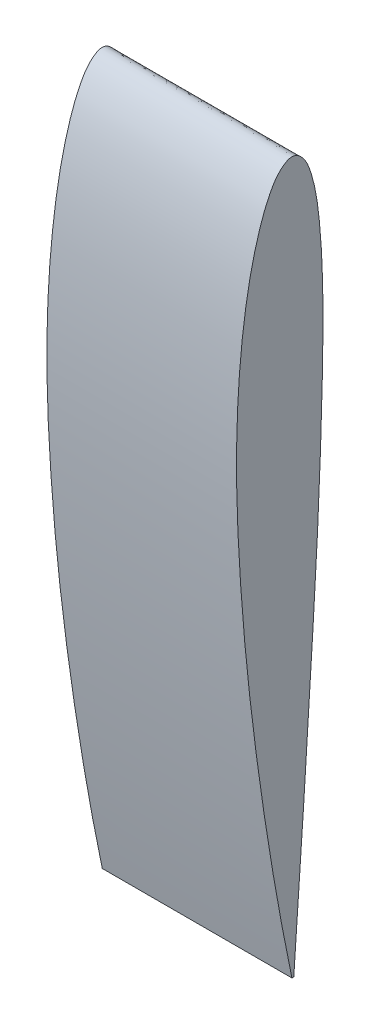
ISO-10303-21;
HEADER;
FILE_DESCRIPTION(('STEP AP214'),'2;1');
FILE_NAME('part.step','',(''),(''),'','','');
FILE_SCHEMA(('AUTOMOTIVE_DESIGN { 1 0 10303 214 1 1 1 1 }'));
ENDSEC;
DATA;
#1=APPLICATION_CONTEXT('core data for automotive mechanical design processes');
#2=APPLICATION_PROTOCOL_DEFINITION('international standard','automotive_design',2000,#1);
#3=PRODUCT_CONTEXT('',#1,'mechanical');
#4=PRODUCT('Part','Part','',(#3));
#5=PRODUCT_RELATED_PRODUCT_CATEGORY('part','',(#4));
#6=PRODUCT_DEFINITION_FORMATION('','',#4);
#7=PRODUCT_DEFINITION_CONTEXT('part definition',#1,'design');
#8=PRODUCT_DEFINITION('design','',#6,#7);
#9=PRODUCT_DEFINITION_SHAPE('','',#8);
#10=(LENGTH_UNIT() NAMED_UNIT(*) SI_UNIT(.MILLI.,.METRE.));
#11=(NAMED_UNIT(*) PLANE_ANGLE_UNIT() SI_UNIT($,.RADIAN.));
#12=(NAMED_UNIT(*) SI_UNIT($,.STERADIAN.) SOLID_ANGLE_UNIT());
#13=UNCERTAINTY_MEASURE_WITH_UNIT(LENGTH_MEASURE(1.E-05),#10,'distance_accuracy_value','');
#14=(GEOMETRIC_REPRESENTATION_CONTEXT(3) GLOBAL_UNCERTAINTY_ASSIGNED_CONTEXT((#13)) GLOBAL_UNIT_ASSIGNED_CONTEXT((#10,
#11,#12)) REPRESENTATION_CONTEXT('',''));
#15=CARTESIAN_POINT('',(0.,0.,0.));
#16=DIRECTION('',(0.,0.,1.));
#17=DIRECTION('',(1.,0.,0.));
#18=AXIS2_PLACEMENT_3D('',#15,#16,#17);
#19=CARTESIAN_POINT('',(-80.0000000000028,-269.756063179744,0.389999999999721));
#20=CARTESIAN_POINT('',(-80.0000000000028,-264.758836377568,1.4140000819557));
#21=CARTESIAN_POINT('',(-80.0000000000027,-254.777507596055,3.4593107902565));
#22=CARTESIAN_POINT('',(-80.0000000000025,-234.797708887649,7.20557933364763));
#23=CARTESIAN_POINT('',(-80.0000000000022,-209.80950222652,11.3564479704609));
#24=CARTESIAN_POINT('',(-80.0000000000019,-179.803810027357,15.6524957785905));
#25=CARTESIAN_POINT('',(-80.0000000000016,-149.803067523875,19.2352409061203));
#26=CARTESIAN_POINT('',(-80.0000000000013,-119.789318532076,21.8585805133961));
#27=CARTESIAN_POINT('',(-80.000000000001,-89.78240469745,23.6350972087241));
#28=CARTESIAN_POINT('',(-80.0000000000008,-64.7467277370218,23.9358084070615));
#29=CARTESIAN_POINT('',(-80.0000000000006,-44.7379186533428,23.1074657207399));
#30=CARTESIAN_POINT('',(-80.0000000000004,-29.7190414152112,21.8937043176692));
#31=CARTESIAN_POINT('',(-80.0000000000002,-14.6812030136909,19.9716341703369));
#32=CARTESIAN_POINT('',(-80.0000000000001,-2.16598238538973,17.6047534607129));
#33=CARTESIAN_POINT('',(-80.,7.81139710874613,14.9269739564238));
#34=CARTESIAN_POINT('',(-79.9999999999999,15.3756598452764,12.4924762739547));
#35=CARTESIAN_POINT('',(-79.9999999999998,21.7844668504533,9.65592082154821));
#36=CARTESIAN_POINT('',(-79.9999999999997,27.3126458331204,6.21691110782117));
#37=CARTESIAN_POINT('',(-79.9999999999997,32.1334055090649,0.269631353648324));
#38=CARTESIAN_POINT('',(-79.9999999999997,27.1259206411494,-4.95792019832863));
#39=CARTESIAN_POINT('',(-79.9999999999998,21.7011450448645,-7.34216026562464));
#40=CARTESIAN_POINT('',(-79.9999999999998,15.3205334317947,-9.15324348589139));
#41=CARTESIAN_POINT('',(-79.9999999999999,7.78117434668768,-10.4517950472663));
#42=CARTESIAN_POINT('',(-80.,-2.2361365754103,-11.5599641576703));
#43=CARTESIAN_POINT('',(-80.0000000000001,-14.7401725412996,-12.4129075723059));
#44=CARTESIAN_POINT('',(-80.0000000000003,-29.7542968012019,-12.7548777124369));
#45=CARTESIAN_POINT('',(-80.0000000000004,-44.757705476586,-12.7072230244066));
#46=CARTESIAN_POINT('',(-80.0000000000006,-64.7595586948496,-12.2657136301747));
#47=CARTESIAN_POINT('',(-80.0000000000009,-89.764209214787,-11.4712429667503));
#48=CARTESIAN_POINT('',(-80.0000000000012,-119.766079926417,-10.088623245738));
#49=CARTESIAN_POINT('',(-80.0000000000015,-149.759251014436,-8.29156110821314));
#50=CARTESIAN_POINT('',(-80.0000000000019,-179.757509221983,-6.42365888730491));
#51=CARTESIAN_POINT('',(-80.0000000000022,-209.760896614152,-4.5329384537317));
#52=CARTESIAN_POINT('',(-80.0000000000024,-234.755492949404,-2.79159322236764));
#53=CARTESIAN_POINT('',(-80.0000000000027,-254.75733530459,-1.44846177238653));
#54=CARTESIAN_POINT('',(-80.0000000000028,-264.75625833608,-0.742836743253439));
#55=CARTESIAN_POINT('',(-80.0000000000028,-269.756063179744,-0.390000000000279));
#56=B_SPLINE_CURVE_WITH_KNOTS('',3,(#19,#20,#21,#22,#23,#24,#25,#26,#27,#28,#29,#30,#31,#32,#33,
#34,#35,#36,#37,#38,#39,#40,#41,#42,#43,#44,#45,#46,#47,#48,#49,#50,#51,#52,#53,#54,#55),
.UNSPECIFIED.,.F.,.F.,(4,1,1,1,1,1,1,1,1,1,1,1,1,1,1,1,1,1,1,1,1,1,1,1,1,1,1,1,1,1,1,1,1,1,4),
(0.,0.0250124897498648,0.0499592861642578,0.0996729249269685,0.149206319909966,
0.198581096615965,0.247805170456832,0.296916574601493,0.345952721793533,0.37049162556991,
0.395091203654929,0.41981479582396,0.444798575016595,0.457489818915221,0.470406405435489,
0.483879408669829,0.491264120322896,0.503458853294664,0.513609129403887,0.520450990700287,
0.533235387615153,0.545691039147803,0.558031884237173,0.582609167247894,0.607134741746914,
0.631652079836766,0.656174271859652,0.705233949250519,0.754320378530032,0.803437363555032,
0.852566095729537,0.901700994033254,0.95084880933727,0.975422716989278,1.),.UNSPECIFIED.);
#57=DIRECTION('',(1.,0.,0.));
#58=VECTOR('',#57,1.);
#59=SURFACE_OF_LINEAR_EXTRUSION('',#56,#58);
#60=CARTESIAN_POINT('',(-2.82690645961775E-12,-269.756063179745,0.39));
#61=CARTESIAN_POINT('',(-2.77813856441758E-12,-264.758836377568,1.41400008195598));
#62=CARTESIAN_POINT('',(-2.68073085905522E-12,-254.777507596055,3.45931079025678));
#63=CARTESIAN_POINT('',(-2.48453360273204E-12,-234.797708887649,7.20557933364791));
#64=CARTESIAN_POINT('',(-2.237288711372E-12,-209.80950222652,11.3564479704612));
#65=CARTESIAN_POINT('',(-1.93799533900752E-12,-179.803810027358,15.6524957785908));
#66=CARTESIAN_POINT('',(-1.63626332895509E-12,-149.803067523876,19.2352409061205));
#67=CARTESIAN_POINT('',(-1.33104533669857E-12,-119.789318532077,21.8585805133964));
#68=CARTESIAN_POINT('',(-1.02294227251884E-12,-89.7824046974508,23.6350972087243));
#69=CARTESIAN_POINT('',(-7.61757403318295E-13,-64.7467277370226,23.9358084070618));
#70=CARTESIAN_POINT('',(-5.49284109702416E-13,-44.7379186533436,23.1074657207402));
#71=CARTESIAN_POINT('',(-3.87731895591849E-13,-29.719041415212,21.8937043176695));
#72=CARTESIAN_POINT('',(-2.23508027074151E-13,-14.6812030136917,19.9716341703371));
#73=CARTESIAN_POINT('',(0.,-2.16598238539057,17.6047534607132));
#74=CARTESIAN_POINT('',(0.,7.81139710874529,14.9269739564241));
#75=CARTESIAN_POINT('',(1.17434240480084E-13,15.3756598452756,12.492476273955));
#76=CARTESIAN_POINT('',(1.94466711097222E-13,21.7844668504525,9.65592082154849));
#77=CARTESIAN_POINT('',(2.64378550604101E-13,27.3126458331196,6.21691110782145));
#78=CARTESIAN_POINT('',(3.35638144225498E-13,32.1334055090641,0.269631353648603));
#79=CARTESIAN_POINT('',(3.01439423004467E-13,27.1259206411485,-4.95792019832836));
#80=CARTESIAN_POINT('',(2.52942444421232E-13,21.7011450448637,-7.34216026562436));
#81=CARTESIAN_POINT('',(1.92432448555568E-13,15.3205334317939,-9.15324348589112));
#82=CARTESIAN_POINT('',(1.17995722442168E-13,7.78117434668684,-10.451795047266));
#83=CARTESIAN_POINT('',(0.,-2.23613657541113,-11.55996415767));
#84=CARTESIAN_POINT('',(-1.11055676928346E-13,-14.7401725413005,-12.4129075723057));
#85=CARTESIAN_POINT('',(-2.67126298583199E-13,-29.7542968012027,-12.7548777124366));
#86=CARTESIAN_POINT('',(-4.24445048264588E-13,-44.7577054765869,-12.7072230244063));
#87=CARTESIAN_POINT('',(-6.35494861837013E-13,-64.7595586948505,-12.2657136301745));
#88=CARTESIAN_POINT('',(-9.00178553356585E-13,-89.7642092147878,-11.47124296675));
#89=CARTESIAN_POINT('',(-1.21925885947134E-12,-119.766079926418,-10.0886232457377));
#90=CARTESIAN_POINT('',(-1.53969505982889E-12,-149.759251014437,-8.29156110821286));
#91=CARTESIAN_POINT('',(-1.86043188176431E-12,-179.757509221983,-6.42365888730463));
#92=CARTESIAN_POINT('',(-2.18130209842063E-12,-209.760896614153,-4.53293845373142));
#93=CARTESIAN_POINT('',(-2.44918647282976E-12,-234.755492949404,-2.79159322236736));
#94=CARTESIAN_POINT('',(-2.66338416919983E-12,-254.757335304591,-1.44846177238625));
#95=CARTESIAN_POINT('',(-2.7705810053402E-12,-264.756258336081,-0.742836743253159));
#96=CARTESIAN_POINT('',(-2.82418310417345E-12,-269.756063179745,-0.39));
#97=B_SPLINE_CURVE_WITH_KNOTS('',3,(#60,#61,#62,#63,#64,#65,#66,#67,#68,#69,#70,#71,#72,#73,#74,
#75,#76,#77,#78,#79,#80,#81,#82,#83,#84,#85,#86,#87,#88,#89,#90,#91,#92,#93,#94,#95,#96),
.UNSPECIFIED.,.F.,.F.,(4,1,1,1,1,1,1,1,1,1,1,1,1,1,1,1,1,1,1,1,1,1,1,1,1,1,1,1,1,1,1,1,1,1,4),
(0.,0.0250124897498648,0.0499592861642578,0.0996729249269685,0.149206319909966,
0.198581096615965,0.247805170456832,0.296916574601493,0.345952721793533,0.37049162556991,
0.395091203654929,0.41981479582396,0.444798575016595,0.457489818915221,0.470406405435489,
0.483879408669829,0.491264120322896,0.503458853294664,0.513609129403887,0.520450990700287,
0.533235387615153,0.545691039147803,0.558031884237173,0.582609167247894,0.607134741746914,
0.631652079836766,0.656174271859652,0.705233949250519,0.754320378530032,0.803437363555032,
0.852566095729537,0.901700994033254,0.95084880933727,0.975422716989278,1.),.UNSPECIFIED.);
#98=CARTESIAN_POINT('',(-2.82690645961775E-12,-269.756063179745,0.39));
#99=VERTEX_POINT('',#98);
#100=CARTESIAN_POINT('',(-2.82418310417345E-12,-269.756063179745,-0.39));
#101=VERTEX_POINT('',#100);
#102=EDGE_CURVE('E81',#99,#101,#97,.T.);
#103=ORIENTED_EDGE('',*,*,#102,.T.);
#104=DIRECTION('',(1.,0.,0.));
#105=VECTOR('',#104,1.);
#106=CARTESIAN_POINT('',(-80.0000000000028,-269.756063179744,-0.390000000000279));
#107=LINE('',#106,#105);
#108=CARTESIAN_POINT('',(-80.0000000000028,-269.756063179744,-0.390000000000279));
#109=VERTEX_POINT('',#108);
#110=EDGE_CURVE('E11',#109,#101,#107,.T.);
#111=ORIENTED_EDGE('',*,*,#110,.F.);
#112=CARTESIAN_POINT('',(-80.0000000000028,-269.756063179744,0.389999999999721));
#113=VERTEX_POINT('',#112);
#114=EDGE_CURVE('E80',#113,#109,#56,.T.);
#115=ORIENTED_EDGE('',*,*,#114,.F.);
#116=DIRECTION('',(1.,0.,0.));
#117=VECTOR('',#116,1.);
#118=CARTESIAN_POINT('',(-80.0000000000028,-269.756063179744,0.389999999999721));
#119=LINE('',#118,#117);
#120=EDGE_CURVE('E57',#113,#99,#119,.T.);
#121=ORIENTED_EDGE('',*,*,#120,.T.);
#122=EDGE_LOOP('',(#103,#111,#115,#121));
#123=FACE_BOUND('',#122,.T.);
#124=ADVANCED_FACE('F47',(#123),#59,.F.);
#125=CARTESIAN_POINT('',(-80.0000000000028,-269.756063179744,0.389999999999721));
#126=DIRECTION('',(0.,1.,0.));
#127=DIRECTION('',(0.,0.,-1.));
#128=AXIS2_PLACEMENT_3D('',#125,#126,#127);
#129=PLANE('',#128);
#130=DIRECTION('',(0.,0.,1.));
#131=VECTOR('',#130,1.);
#132=CARTESIAN_POINT('',(-2.82690645961775E-12,-269.756063179745,0.39));
#133=LINE('',#132,#131);
#134=EDGE_CURVE('E72',#101,#99,#133,.T.);
#135=ORIENTED_EDGE('',*,*,#134,.T.);
#136=ORIENTED_EDGE('',*,*,#120,.F.);
#137=DIRECTION('',(0.,0.,1.));
#138=VECTOR('',#137,1.);
#139=CARTESIAN_POINT('',(-80.0000000000028,-269.756063179744,0.389999999999721));
#140=LINE('',#139,#138);
#141=EDGE_CURVE('E64',#109,#113,#140,.T.);
#142=ORIENTED_EDGE('',*,*,#141,.F.);
#143=ORIENTED_EDGE('',*,*,#110,.T.);
#144=EDGE_LOOP('',(#135,#136,#142,#143));
#145=FACE_BOUND('',#144,.T.);
#146=ADVANCED_FACE('F75',(#145),#129,.F.);
#147=CARTESIAN_POINT('',(-79.9999999999997,29.964961624778,1.97101787544317));
#148=DIRECTION('',(1.,0.,0.));
#149=DIRECTION('',(0.,1.,0.));
#150=AXIS2_PLACEMENT_3D('',#147,#148,#149);
#151=PLANE('',#150);
#152=ORIENTED_EDGE('',*,*,#114,.T.);
#153=ORIENTED_EDGE('',*,*,#141,.T.);
#154=EDGE_LOOP('',(#152,#153));
#155=FACE_BOUND('',#154,.T.);
#156=ADVANCED_FACE('F102',(#155),#151,.F.);
#157=CARTESIAN_POINT('',(3.06984540865544E-13,29.9649616247772,1.97101787544345));
#158=DIRECTION('',(1.,0.,0.));
#159=DIRECTION('',(0.,1.,0.));
#160=AXIS2_PLACEMENT_3D('',#157,#158,#159);
#161=PLANE('',#160);
#162=ORIENTED_EDGE('',*,*,#102,.F.);
#163=ORIENTED_EDGE('',*,*,#134,.F.);
#164=EDGE_LOOP('',(#162,#163));
#165=FACE_BOUND('',#164,.T.);
#166=ADVANCED_FACE('F85',(#165),#161,.T.);
#167=CLOSED_SHELL('',(#124,#146,#156,#166));
#168=MANIFOLD_SOLID_BREP('B2',#167);
#169=ADVANCED_BREP_SHAPE_REPRESENTATION('',(#18,#168),#14);
#170=SHAPE_DEFINITION_REPRESENTATION(#9,#169);
ENDSEC;
END-ISO-10303-21;
